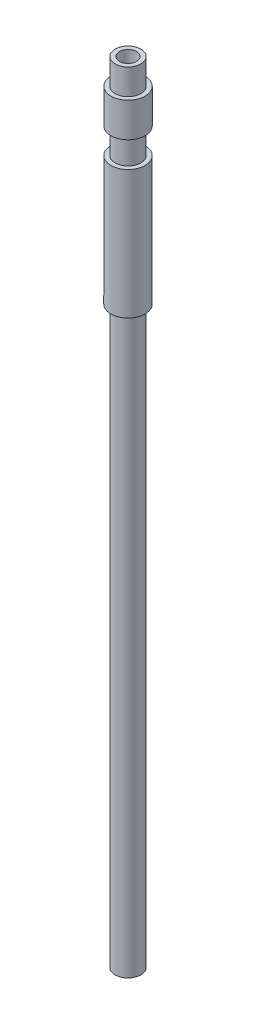
ISO-10303-21;
HEADER;
FILE_DESCRIPTION(('STEP AP214'),'2;1');
FILE_NAME('part.step','',(''),(''),'','','');
FILE_SCHEMA(('AUTOMOTIVE_DESIGN { 1 0 10303 214 1 1 1 1 }'));
ENDSEC;
DATA;
#1=APPLICATION_CONTEXT('core data for automotive mechanical design processes');
#2=APPLICATION_PROTOCOL_DEFINITION('international standard','automotive_design',2000,#1);
#3=PRODUCT_CONTEXT('',#1,'mechanical');
#4=PRODUCT('Part','Part','',(#3));
#5=PRODUCT_RELATED_PRODUCT_CATEGORY('part','',(#4));
#6=PRODUCT_DEFINITION_FORMATION('','',#4);
#7=PRODUCT_DEFINITION_CONTEXT('part definition',#1,'design');
#8=PRODUCT_DEFINITION('design','',#6,#7);
#9=PRODUCT_DEFINITION_SHAPE('','',#8);
#10=(LENGTH_UNIT() NAMED_UNIT(*) SI_UNIT(.MILLI.,.METRE.));
#11=(NAMED_UNIT(*) PLANE_ANGLE_UNIT() SI_UNIT($,.RADIAN.));
#12=(NAMED_UNIT(*) SI_UNIT($,.STERADIAN.) SOLID_ANGLE_UNIT());
#13=UNCERTAINTY_MEASURE_WITH_UNIT(LENGTH_MEASURE(1.E-05),#10,'distance_accuracy_value','');
#14=(GEOMETRIC_REPRESENTATION_CONTEXT(3) GLOBAL_UNCERTAINTY_ASSIGNED_CONTEXT((#13)) GLOBAL_UNIT_ASSIGNED_CONTEXT((#10,
#11,#12)) REPRESENTATION_CONTEXT('',''));
#15=CARTESIAN_POINT('',(0.,0.,0.));
#16=DIRECTION('',(0.,0.,1.));
#17=DIRECTION('',(1.,0.,0.));
#18=AXIS2_PLACEMENT_3D('',#15,#16,#17);
#19=CARTESIAN_POINT('',(0.,0.,0.));
#20=DIRECTION('',(0.,1.,0.));
#21=DIRECTION('',(0.,0.,1.));
#22=AXIS2_PLACEMENT_3D('',#19,#20,#21);
#23=PLANE('',#22);
#24=CARTESIAN_POINT('',(0.,0.,0.));
#25=DIRECTION('',(0.,1.,0.));
#26=DIRECTION('',(0.,0.,1.));
#27=AXIS2_PLACEMENT_3D('',#24,#25,#26);
#28=CIRCLE('',#27,1.);
#29=CARTESIAN_POINT('',(0.,0.,1.));
#30=VERTEX_POINT('',#29);
#31=EDGE_CURVE('E36',#30,#30,#28,.T.);
#32=ORIENTED_EDGE('',*,*,#31,.T.);
#33=EDGE_LOOP('',(#32));
#34=FACE_BOUND('',#33,.T.);
#35=CARTESIAN_POINT('',(0.,0.,0.));
#36=DIRECTION('',(0.,-1.,0.));
#37=DIRECTION('',(0.,0.,-1.));
#38=AXIS2_PLACEMENT_3D('',#35,#36,#37);
#39=CIRCLE('',#38,1.5);
#40=CARTESIAN_POINT('',(0.,0.,-1.5));
#41=VERTEX_POINT('',#40);
#42=EDGE_CURVE('E71',#41,#41,#39,.T.);
#43=ORIENTED_EDGE('',*,*,#42,.T.);
#44=EDGE_LOOP('',(#43));
#45=FACE_BOUND('',#44,.T.);
#46=ADVANCED_FACE('F32',(#34,#45),#23,.F.);
#47=CARTESIAN_POINT('',(0.,92.,0.));
#48=DIRECTION('',(0.,-1.,0.));
#49=DIRECTION('',(0.,0.,-1.));
#50=AXIS2_PLACEMENT_3D('',#47,#48,#49);
#51=CYLINDRICAL_SURFACE('',#50,2.);
#52=CARTESIAN_POINT('',(0.,67.,0.));
#53=DIRECTION('',(0.,-1.,0.));
#54=DIRECTION('',(0.,0.,-1.));
#55=AXIS2_PLACEMENT_3D('',#52,#53,#54);
#56=CIRCLE('',#55,1.99999999999999);
#57=CARTESIAN_POINT('',(0.,67.,-1.99999999999999));
#58=VERTEX_POINT('',#57);
#59=EDGE_CURVE('E65',#58,#58,#56,.T.);
#60=ORIENTED_EDGE('',*,*,#59,.F.);
#61=EDGE_LOOP('',(#60));
#62=FACE_BOUND('',#61,.T.);
#63=CARTESIAN_POINT('',(0.,82.,0.));
#64=DIRECTION('',(0.,1.,0.));
#65=DIRECTION('',(0.,0.,1.));
#66=AXIS2_PLACEMENT_3D('',#63,#64,#65);
#67=CIRCLE('',#66,2.);
#68=CARTESIAN_POINT('',(0.,82.,2.));
#69=VERTEX_POINT('',#68);
#70=EDGE_CURVE('E53',#69,#69,#67,.T.);
#71=ORIENTED_EDGE('',*,*,#70,.F.);
#72=EDGE_LOOP('',(#71));
#73=FACE_BOUND('',#72,.T.);
#74=ADVANCED_FACE('F34',(#62,#73),#51,.T.);
#75=CARTESIAN_POINT('',(0.,89.,0.));
#76=DIRECTION('',(0.,1.,0.));
#77=DIRECTION('',(0.,0.,1.));
#78=AXIS2_PLACEMENT_3D('',#75,#76,#77);
#79=CIRCLE('',#78,2.);
#80=CARTESIAN_POINT('',(0.,89.,2.));
#81=VERTEX_POINT('',#80);
#82=EDGE_CURVE('E43',#81,#81,#79,.T.);
#83=ORIENTED_EDGE('',*,*,#82,.F.);
#84=EDGE_LOOP('',(#83));
#85=FACE_BOUND('',#84,.T.);
#86=CARTESIAN_POINT('',(0.,85.,0.));
#87=DIRECTION('',(0.,1.,0.));
#88=DIRECTION('',(0.,0.,1.));
#89=AXIS2_PLACEMENT_3D('',#86,#87,#88);
#90=CIRCLE('',#89,2.);
#91=CARTESIAN_POINT('',(0.,85.,2.));
#92=VERTEX_POINT('',#91);
#93=EDGE_CURVE('E62',#92,#92,#90,.T.);
#94=ORIENTED_EDGE('',*,*,#93,.T.);
#95=EDGE_LOOP('',(#94));
#96=FACE_BOUND('',#95,.T.);
#97=ADVANCED_FACE('F91',(#85,#96),#51,.T.);
#98=CARTESIAN_POINT('',(0.,92.,0.));
#99=DIRECTION('',(0.,1.,0.));
#100=DIRECTION('',(0.,0.,1.));
#101=AXIS2_PLACEMENT_3D('',#98,#99,#100);
#102=PLANE('',#101);
#103=CARTESIAN_POINT('',(0.,92.,0.));
#104=DIRECTION('',(0.,1.,0.));
#105=DIRECTION('',(0.,0.,1.));
#106=AXIS2_PLACEMENT_3D('',#103,#104,#105);
#107=CIRCLE('',#106,1.);
#108=CARTESIAN_POINT('',(0.,92.,1.));
#109=VERTEX_POINT('',#108);
#110=EDGE_CURVE('E10',#109,#109,#107,.T.);
#111=ORIENTED_EDGE('',*,*,#110,.F.);
#112=EDGE_LOOP('',(#111));
#113=FACE_BOUND('',#112,.T.);
#114=CARTESIAN_POINT('',(0.,92.,0.));
#115=DIRECTION('',(0.,1.,0.));
#116=DIRECTION('',(0.,0.,1.));
#117=AXIS2_PLACEMENT_3D('',#114,#115,#116);
#118=CIRCLE('',#117,1.5);
#119=CARTESIAN_POINT('',(0.,92.,1.5));
#120=VERTEX_POINT('',#119);
#121=EDGE_CURVE('E50',#120,#120,#118,.T.);
#122=ORIENTED_EDGE('',*,*,#121,.T.);
#123=EDGE_LOOP('',(#122));
#124=FACE_BOUND('',#123,.T.);
#125=ADVANCED_FACE('F113',(#113,#124),#102,.T.);
#126=CARTESIAN_POINT('',(0.,92.,0.));
#127=DIRECTION('',(0.,-1.,0.));
#128=DIRECTION('',(0.,0.,-1.));
#129=AXIS2_PLACEMENT_3D('',#126,#127,#128);
#130=CYLINDRICAL_SURFACE('',#129,1.);
#131=ORIENTED_EDGE('',*,*,#110,.T.);
#132=EDGE_LOOP('',(#131));
#133=FACE_BOUND('',#132,.T.);
#134=ORIENTED_EDGE('',*,*,#31,.F.);
#135=EDGE_LOOP('',(#134));
#136=FACE_BOUND('',#135,.T.);
#137=ADVANCED_FACE('F118',(#133,#136),#130,.F.);
#138=CARTESIAN_POINT('',(2.,89.,0.));
#139=DIRECTION('',(0.,1.,0.));
#140=DIRECTION('',(0.,0.,1.));
#141=AXIS2_PLACEMENT_3D('',#138,#139,#140);
#142=PLANE('',#141);
#143=ORIENTED_EDGE('',*,*,#82,.T.);
#144=EDGE_LOOP('',(#143));
#145=FACE_BOUND('',#144,.T.);
#146=CARTESIAN_POINT('',(0.,89.,0.));
#147=DIRECTION('',(0.,1.,0.));
#148=DIRECTION('',(0.,0.,1.));
#149=AXIS2_PLACEMENT_3D('',#146,#147,#148);
#150=CIRCLE('',#149,1.5);
#151=CARTESIAN_POINT('',(0.,89.,1.5));
#152=VERTEX_POINT('',#151);
#153=EDGE_CURVE('E47',#152,#152,#150,.T.);
#154=ORIENTED_EDGE('',*,*,#153,.F.);
#155=EDGE_LOOP('',(#154));
#156=FACE_BOUND('',#155,.T.);
#157=ADVANCED_FACE('F129',(#145,#156),#142,.T.);
#158=CARTESIAN_POINT('',(0.,92.,0.));
#159=DIRECTION('',(0.,1.,0.));
#160=DIRECTION('',(0.,0.,1.));
#161=AXIS2_PLACEMENT_3D('',#158,#159,#160);
#162=CYLINDRICAL_SURFACE('',#161,1.5);
#163=ORIENTED_EDGE('',*,*,#153,.T.);
#164=EDGE_LOOP('',(#163));
#165=FACE_BOUND('',#164,.T.);
#166=ORIENTED_EDGE('',*,*,#121,.F.);
#167=EDGE_LOOP('',(#166));
#168=FACE_BOUND('',#167,.T.);
#169=ADVANCED_FACE('F98',(#165,#168),#162,.T.);
#170=CARTESIAN_POINT('',(2.,82.,0.));
#171=DIRECTION('',(0.,1.,0.));
#172=DIRECTION('',(0.,0.,1.));
#173=AXIS2_PLACEMENT_3D('',#170,#171,#172);
#174=PLANE('',#173);
#175=ORIENTED_EDGE('',*,*,#70,.T.);
#176=EDGE_LOOP('',(#175));
#177=FACE_BOUND('',#176,.T.);
#178=CARTESIAN_POINT('',(0.,82.,0.));
#179=DIRECTION('',(0.,1.,0.));
#180=DIRECTION('',(0.,0.,1.));
#181=AXIS2_PLACEMENT_3D('',#178,#179,#180);
#182=CIRCLE('',#181,1.5);
#183=CARTESIAN_POINT('',(0.,82.,1.5));
#184=VERTEX_POINT('',#183);
#185=EDGE_CURVE('E56',#184,#184,#182,.T.);
#186=ORIENTED_EDGE('',*,*,#185,.F.);
#187=EDGE_LOOP('',(#186));
#188=FACE_BOUND('',#187,.T.);
#189=ADVANCED_FACE('F94',(#177,#188),#174,.T.);
#190=CARTESIAN_POINT('',(0.,92.,0.));
#191=DIRECTION('',(0.,1.,0.));
#192=DIRECTION('',(0.,0.,1.));
#193=AXIS2_PLACEMENT_3D('',#190,#191,#192);
#194=CYLINDRICAL_SURFACE('',#193,1.5);
#195=ORIENTED_EDGE('',*,*,#185,.T.);
#196=EDGE_LOOP('',(#195));
#197=FACE_BOUND('',#196,.T.);
#198=CARTESIAN_POINT('',(0.,85.,0.));
#199=DIRECTION('',(0.,1.,0.));
#200=DIRECTION('',(0.,0.,1.));
#201=AXIS2_PLACEMENT_3D('',#198,#199,#200);
#202=CIRCLE('',#201,1.5);
#203=CARTESIAN_POINT('',(0.,85.,1.5));
#204=VERTEX_POINT('',#203);
#205=EDGE_CURVE('E59',#204,#204,#202,.T.);
#206=ORIENTED_EDGE('',*,*,#205,.F.);
#207=EDGE_LOOP('',(#206));
#208=FACE_BOUND('',#207,.T.);
#209=ADVANCED_FACE('F97',(#197,#208),#194,.T.);
#210=CARTESIAN_POINT('',(2.,85.,0.));
#211=DIRECTION('',(0.,-1.,0.));
#212=DIRECTION('',(0.,0.,-1.));
#213=AXIS2_PLACEMENT_3D('',#210,#211,#212);
#214=PLANE('',#213);
#215=ORIENTED_EDGE('',*,*,#205,.T.);
#216=EDGE_LOOP('',(#215));
#217=FACE_BOUND('',#216,.T.);
#218=ORIENTED_EDGE('',*,*,#93,.F.);
#219=EDGE_LOOP('',(#218));
#220=FACE_BOUND('',#219,.T.);
#221=ADVANCED_FACE('F85',(#217,#220),#214,.T.);
#222=CARTESIAN_POINT('',(1.99999999999999,67.,0.));
#223=DIRECTION('',(0.,1.,0.));
#224=DIRECTION('',(0.,0.,1.));
#225=AXIS2_PLACEMENT_3D('',#222,#223,#224);
#226=PLANE('',#225);
#227=CARTESIAN_POINT('',(0.,67.,0.));
#228=DIRECTION('',(0.,-1.,0.));
#229=DIRECTION('',(0.,0.,-1.));
#230=AXIS2_PLACEMENT_3D('',#227,#228,#229);
#231=CIRCLE('',#230,1.49999999999999);
#232=CARTESIAN_POINT('',(0.,67.,-1.49999999999999));
#233=VERTEX_POINT('',#232);
#234=EDGE_CURVE('E68',#233,#233,#231,.T.);
#235=ORIENTED_EDGE('',*,*,#234,.F.);
#236=EDGE_LOOP('',(#235));
#237=FACE_BOUND('',#236,.T.);
#238=ORIENTED_EDGE('',*,*,#59,.T.);
#239=EDGE_LOOP('',(#238));
#240=FACE_BOUND('',#239,.T.);
#241=ADVANCED_FACE('F79',(#237,#240),#226,.F.);
#242=CARTESIAN_POINT('',(0.,0.,0.));
#243=DIRECTION('',(0.,-1.,0.));
#244=DIRECTION('',(0.,0.,-1.));
#245=AXIS2_PLACEMENT_3D('',#242,#243,#244);
#246=CYLINDRICAL_SURFACE('',#245,1.49999999999999);
#247=ORIENTED_EDGE('',*,*,#42,.F.);
#248=EDGE_LOOP('',(#247));
#249=FACE_BOUND('',#248,.T.);
#250=ORIENTED_EDGE('',*,*,#234,.T.);
#251=EDGE_LOOP('',(#250));
#252=FACE_BOUND('',#251,.T.);
#253=ADVANCED_FACE('F76',(#249,#252),#246,.T.);
#254=CLOSED_SHELL('',(#46,#74,#97,#125,#137,#157,#169,#189,#209,#221,#241,#253));
#255=MANIFOLD_SOLID_BREP('B2',#254);
#256=ADVANCED_BREP_SHAPE_REPRESENTATION('',(#18,#255),#14);
#257=SHAPE_DEFINITION_REPRESENTATION(#9,#256);
ENDSEC;
END-ISO-10303-21;
